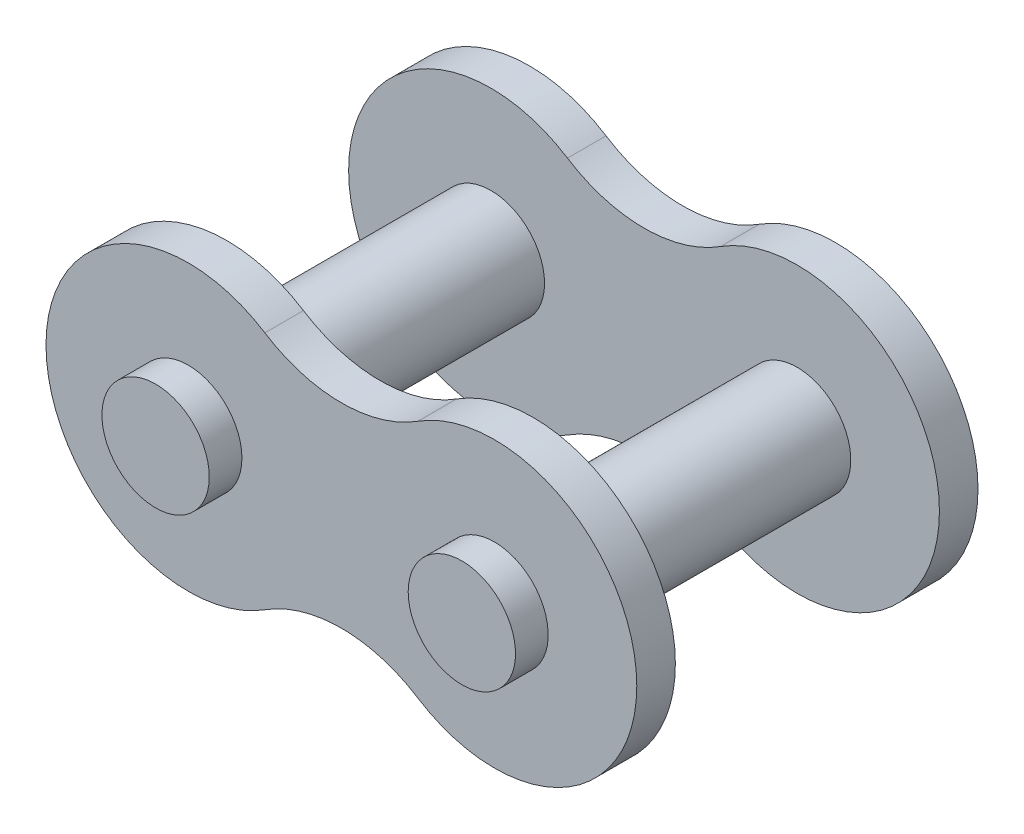
ISO-10303-21;
HEADER;
FILE_DESCRIPTION(('STEP AP214'),'2;1');
FILE_NAME('part.step','',(''),(''),'','','');
FILE_SCHEMA(('AUTOMOTIVE_DESIGN { 1 0 10303 214 1 1 1 1 }'));
ENDSEC;
DATA;
#1=APPLICATION_CONTEXT('core data for automotive mechanical design processes');
#2=APPLICATION_PROTOCOL_DEFINITION('international standard','automotive_design',2000,#1);
#3=PRODUCT_CONTEXT('',#1,'mechanical');
#4=PRODUCT('Part','Part','',(#3));
#5=PRODUCT_RELATED_PRODUCT_CATEGORY('part','',(#4));
#6=PRODUCT_DEFINITION_FORMATION('','',#4);
#7=PRODUCT_DEFINITION_CONTEXT('part definition',#1,'design');
#8=PRODUCT_DEFINITION('design','',#6,#7);
#9=PRODUCT_DEFINITION_SHAPE('','',#8);
#10=(LENGTH_UNIT() NAMED_UNIT(*) SI_UNIT(.MILLI.,.METRE.));
#11=(NAMED_UNIT(*) PLANE_ANGLE_UNIT() SI_UNIT($,.RADIAN.));
#12=(NAMED_UNIT(*) SI_UNIT($,.STERADIAN.) SOLID_ANGLE_UNIT());
#13=UNCERTAINTY_MEASURE_WITH_UNIT(LENGTH_MEASURE(1.E-05),#10,'distance_accuracy_value','');
#14=(GEOMETRIC_REPRESENTATION_CONTEXT(3) GLOBAL_UNCERTAINTY_ASSIGNED_CONTEXT((#13)) GLOBAL_UNIT_ASSIGNED_CONTEXT((#10,
#11,#12)) REPRESENTATION_CONTEXT('',''));
#15=CARTESIAN_POINT('',(0.,0.,0.));
#16=DIRECTION('',(0.,0.,1.));
#17=DIRECTION('',(1.,0.,0.));
#18=AXIS2_PLACEMENT_3D('',#15,#16,#17);
#19=CARTESIAN_POINT('',(-6.35,0.,-7.075));
#20=DIRECTION('',(0.,0.,1.));
#21=DIRECTION('',(1.,0.,0.));
#22=AXIS2_PLACEMENT_3D('',#19,#20,#21);
#23=CYLINDRICAL_SURFACE('',#22,5.9);
#24=CARTESIAN_POINT('',(-6.35,0.,-5.475));
#25=DIRECTION('',(0.,0.,1.));
#26=DIRECTION('',(1.,0.,0.));
#27=AXIS2_PLACEMENT_3D('',#24,#25,#26);
#28=CIRCLE('',#27,5.9);
#29=CARTESIAN_POINT('',(-3.175,4.97286386300691,-5.475));
#30=VERTEX_POINT('',#29);
#31=CARTESIAN_POINT('',(-3.175,-4.97286386300691,-5.475));
#32=VERTEX_POINT('',#31);
#33=EDGE_CURVE('E118',#30,#32,#28,.T.);
#34=ORIENTED_EDGE('',*,*,#33,.F.);
#35=DIRECTION('',(0.,0.,1.));
#36=VECTOR('',#35,1.);
#37=CARTESIAN_POINT('',(-3.175,4.97286386300691,-7.075));
#38=LINE('',#37,#36);
#39=CARTESIAN_POINT('',(-3.175,4.97286386300691,-7.075));
#40=VERTEX_POINT('',#39);
#41=EDGE_CURVE('E43',#40,#30,#38,.T.);
#42=ORIENTED_EDGE('',*,*,#41,.F.);
#43=CARTESIAN_POINT('',(-6.35,0.,-7.075));
#44=DIRECTION('',(0.,0.,1.));
#45=DIRECTION('',(1.,0.,0.));
#46=AXIS2_PLACEMENT_3D('',#43,#44,#45);
#47=CIRCLE('',#46,5.9);
#48=CARTESIAN_POINT('',(-3.175,-4.97286386300691,-7.075));
#49=VERTEX_POINT('',#48);
#50=EDGE_CURVE('E87',#40,#49,#47,.T.);
#51=ORIENTED_EDGE('',*,*,#50,.T.);
#52=DIRECTION('',(0.,0.,1.));
#53=VECTOR('',#52,1.);
#54=CARTESIAN_POINT('',(-3.175,-4.97286386300691,-7.075));
#55=LINE('',#54,#53);
#56=EDGE_CURVE('E58',#49,#32,#55,.T.);
#57=ORIENTED_EDGE('',*,*,#56,.T.);
#58=EDGE_LOOP('',(#34,#42,#51,#57));
#59=FACE_BOUND('',#58,.T.);
#60=ADVANCED_FACE('F35',(#59),#23,.T.);
#61=CARTESIAN_POINT('',(0.,9.94572772601382,-7.075));
#62=DIRECTION('',(0.,0.,1.));
#63=DIRECTION('',(1.,0.,0.));
#64=AXIS2_PLACEMENT_3D('',#61,#62,#63);
#65=CYLINDRICAL_SURFACE('',#64,5.9);
#66=CARTESIAN_POINT('',(0.,9.94572772601382,-5.475));
#67=DIRECTION('',(0.,0.,1.));
#68=DIRECTION('',(1.,0.,0.));
#69=AXIS2_PLACEMENT_3D('',#66,#67,#68);
#70=CIRCLE('',#69,5.9);
#71=CARTESIAN_POINT('',(3.175,4.97286386300691,-5.475));
#72=VERTEX_POINT('',#71);
#73=EDGE_CURVE('E79',#30,#72,#70,.T.);
#74=ORIENTED_EDGE('',*,*,#73,.T.);
#75=DIRECTION('',(0.,0.,1.));
#76=VECTOR('',#75,1.);
#77=CARTESIAN_POINT('',(3.175,4.97286386300691,-7.075));
#78=LINE('',#77,#76);
#79=CARTESIAN_POINT('',(3.175,4.97286386300691,-7.075));
#80=VERTEX_POINT('',#79);
#81=EDGE_CURVE('E82',#80,#72,#78,.T.);
#82=ORIENTED_EDGE('',*,*,#81,.F.);
#83=CARTESIAN_POINT('',(0.,9.94572772601382,-7.075));
#84=DIRECTION('',(0.,0.,1.));
#85=DIRECTION('',(1.,0.,0.));
#86=AXIS2_PLACEMENT_3D('',#83,#84,#85);
#87=CIRCLE('',#86,5.9);
#88=EDGE_CURVE('E66',#40,#80,#87,.T.);
#89=ORIENTED_EDGE('',*,*,#88,.F.);
#90=ORIENTED_EDGE('',*,*,#41,.T.);
#91=EDGE_LOOP('',(#74,#82,#89,#90));
#92=FACE_BOUND('',#91,.T.);
#93=ADVANCED_FACE('F81',(#92),#65,.F.);
#94=CARTESIAN_POINT('',(0.,-9.94572772601382,-7.075));
#95=DIRECTION('',(0.,0.,1.));
#96=DIRECTION('',(1.,0.,0.));
#97=AXIS2_PLACEMENT_3D('',#94,#95,#96);
#98=CYLINDRICAL_SURFACE('',#97,5.9);
#99=CARTESIAN_POINT('',(0.,-9.94572772601382,-5.475));
#100=DIRECTION('',(0.,0.,-1.));
#101=DIRECTION('',(-1.,0.,0.));
#102=AXIS2_PLACEMENT_3D('',#99,#100,#101);
#103=CIRCLE('',#102,5.9);
#104=CARTESIAN_POINT('',(3.175,-4.97286386300691,-5.475));
#105=VERTEX_POINT('',#104);
#106=EDGE_CURVE('E88',#32,#105,#103,.T.);
#107=ORIENTED_EDGE('',*,*,#106,.F.);
#108=ORIENTED_EDGE('',*,*,#56,.F.);
#109=CARTESIAN_POINT('',(0.,-9.94572772601382,-7.075));
#110=DIRECTION('',(0.,0.,-1.));
#111=DIRECTION('',(-1.,0.,0.));
#112=AXIS2_PLACEMENT_3D('',#109,#110,#111);
#113=CIRCLE('',#112,5.9);
#114=CARTESIAN_POINT('',(3.175,-4.97286386300691,-7.075));
#115=VERTEX_POINT('',#114);
#116=EDGE_CURVE('E120',#49,#115,#113,.T.);
#117=ORIENTED_EDGE('',*,*,#116,.T.);
#118=DIRECTION('',(0.,0.,1.));
#119=VECTOR('',#118,1.);
#120=CARTESIAN_POINT('',(3.175,-4.97286386300691,-7.075));
#121=LINE('',#120,#119);
#122=EDGE_CURVE('E97',#115,#105,#121,.T.);
#123=ORIENTED_EDGE('',*,*,#122,.T.);
#124=EDGE_LOOP('',(#107,#108,#117,#123));
#125=FACE_BOUND('',#124,.T.);
#126=ADVANCED_FACE('F129',(#125),#98,.F.);
#127=CARTESIAN_POINT('',(-6.35,0.,-7.075));
#128=DIRECTION('',(0.,0.,1.));
#129=DIRECTION('',(1.,0.,0.));
#130=AXIS2_PLACEMENT_3D('',#127,#128,#129);
#131=PLANE('',#130);
#132=CARTESIAN_POINT('',(-6.35,0.,-7.075));
#133=DIRECTION('',(0.,0.,1.));
#134=DIRECTION('',(1.,0.,0.));
#135=AXIS2_PLACEMENT_3D('',#132,#133,#134);
#136=CIRCLE('',#135,2.225);
#137=CARTESIAN_POINT('',(-4.125,0.,-7.075));
#138=VERTEX_POINT('',#137);
#139=EDGE_CURVE('E115',#138,#138,#136,.T.);
#140=ORIENTED_EDGE('',*,*,#139,.T.);
#141=EDGE_LOOP('',(#140));
#142=FACE_BOUND('',#141,.T.);
#143=ORIENTED_EDGE('',*,*,#50,.F.);
#144=ORIENTED_EDGE('',*,*,#88,.T.);
#145=CARTESIAN_POINT('',(6.35,0.,-7.075));
#146=DIRECTION('',(0.,0.,-1.));
#147=DIRECTION('',(-1.,0.,0.));
#148=AXIS2_PLACEMENT_3D('',#145,#146,#147);
#149=CIRCLE('',#148,5.9);
#150=EDGE_CURVE('E95',#80,#115,#149,.T.);
#151=ORIENTED_EDGE('',*,*,#150,.T.);
#152=ORIENTED_EDGE('',*,*,#116,.F.);
#153=EDGE_LOOP('',(#143,#144,#151,#152));
#154=FACE_BOUND('',#153,.T.);
#155=CARTESIAN_POINT('',(6.35,0.,-7.075));
#156=DIRECTION('',(0.,0.,-1.));
#157=DIRECTION('',(-1.,0.,0.));
#158=AXIS2_PLACEMENT_3D('',#155,#156,#157);
#159=CIRCLE('',#158,2.225);
#160=CARTESIAN_POINT('',(4.125,0.,-7.075));
#161=VERTEX_POINT('',#160);
#162=EDGE_CURVE('E102',#161,#161,#159,.T.);
#163=ORIENTED_EDGE('',*,*,#162,.F.);
#164=EDGE_LOOP('',(#163));
#165=FACE_BOUND('',#164,.T.);
#166=ADVANCED_FACE('F134',(#142,#154,#165),#131,.F.);
#167=CARTESIAN_POINT('',(-6.35,0.,-5.475));
#168=DIRECTION('',(0.,0.,1.));
#169=DIRECTION('',(1.,0.,0.));
#170=AXIS2_PLACEMENT_3D('',#167,#168,#169);
#171=PLANE('',#170);
#172=CARTESIAN_POINT('',(-6.35,0.,-5.475));
#173=DIRECTION('',(0.,0.,1.));
#174=DIRECTION('',(1.,0.,0.));
#175=AXIS2_PLACEMENT_3D('',#172,#173,#174);
#176=CIRCLE('',#175,2.225);
#177=CARTESIAN_POINT('',(-4.125,0.,-5.475));
#178=VERTEX_POINT('',#177);
#179=EDGE_CURVE('E11',#178,#178,#176,.T.);
#180=ORIENTED_EDGE('',*,*,#179,.F.);
#181=EDGE_LOOP('',(#180));
#182=FACE_BOUND('',#181,.T.);
#183=ORIENTED_EDGE('',*,*,#33,.T.);
#184=ORIENTED_EDGE('',*,*,#106,.T.);
#185=CARTESIAN_POINT('',(6.35,0.,-5.475));
#186=DIRECTION('',(0.,0.,-1.));
#187=DIRECTION('',(-1.,0.,0.));
#188=AXIS2_PLACEMENT_3D('',#185,#186,#187);
#189=CIRCLE('',#188,5.9);
#190=EDGE_CURVE('E94',#72,#105,#189,.T.);
#191=ORIENTED_EDGE('',*,*,#190,.F.);
#192=ORIENTED_EDGE('',*,*,#73,.F.);
#193=EDGE_LOOP('',(#183,#184,#191,#192));
#194=FACE_BOUND('',#193,.T.);
#195=CARTESIAN_POINT('',(6.35,0.,-5.475));
#196=DIRECTION('',(0.,0.,-1.));
#197=DIRECTION('',(-1.,0.,0.));
#198=AXIS2_PLACEMENT_3D('',#195,#196,#197);
#199=CIRCLE('',#198,2.225);
#200=CARTESIAN_POINT('',(4.125,0.,-5.475));
#201=VERTEX_POINT('',#200);
#202=EDGE_CURVE('E96',#201,#201,#199,.T.);
#203=ORIENTED_EDGE('',*,*,#202,.T.);
#204=EDGE_LOOP('',(#203));
#205=FACE_BOUND('',#204,.T.);
#206=ADVANCED_FACE('F99',(#182,#194,#205),#171,.T.);
#207=CARTESIAN_POINT('',(-6.35,0.,-8.43));
#208=DIRECTION('',(0.,0.,1.));
#209=DIRECTION('',(1.,0.,0.));
#210=AXIS2_PLACEMENT_3D('',#207,#208,#209);
#211=CYLINDRICAL_SURFACE('',#210,2.225);
#212=ORIENTED_EDGE('',*,*,#179,.T.);
#213=EDGE_LOOP('',(#212));
#214=FACE_BOUND('',#213,.T.);
#215=CARTESIAN_POINT('',(-6.35,0.,5.475));
#216=DIRECTION('',(0.,0.,1.));
#217=DIRECTION('',(1.,0.,0.));
#218=AXIS2_PLACEMENT_3D('',#215,#216,#217);
#219=CIRCLE('',#218,2.225);
#220=CARTESIAN_POINT('',(-4.125,0.,5.475));
#221=VERTEX_POINT('',#220);
#222=EDGE_CURVE('E255',#221,#221,#219,.T.);
#223=ORIENTED_EDGE('',*,*,#222,.F.);
#224=EDGE_LOOP('',(#223));
#225=FACE_BOUND('',#224,.T.);
#226=ADVANCED_FACE('F139',(#214,#225),#211,.T.);
#227=CARTESIAN_POINT('',(-6.35,0.,-8.43));
#228=DIRECTION('',(0.,0.,1.));
#229=DIRECTION('',(1.,0.,0.));
#230=AXIS2_PLACEMENT_3D('',#227,#228,#229);
#231=CIRCLE('',#230,2.225);
#232=CARTESIAN_POINT('',(-4.125,0.,-8.43));
#233=VERTEX_POINT('',#232);
#234=EDGE_CURVE('E112',#233,#233,#231,.T.);
#235=ORIENTED_EDGE('',*,*,#234,.T.);
#236=EDGE_LOOP('',(#235));
#237=FACE_BOUND('',#236,.T.);
#238=ORIENTED_EDGE('',*,*,#139,.F.);
#239=EDGE_LOOP('',(#238));
#240=FACE_BOUND('',#239,.T.);
#241=ADVANCED_FACE('F146',(#237,#240),#211,.T.);
#242=CARTESIAN_POINT('',(-6.35,0.,-8.43));
#243=DIRECTION('',(0.,0.,1.));
#244=DIRECTION('',(1.,0.,0.));
#245=AXIS2_PLACEMENT_3D('',#242,#243,#244);
#246=PLANE('',#245);
#247=ORIENTED_EDGE('',*,*,#234,.F.);
#248=EDGE_LOOP('',(#247));
#249=FACE_BOUND('',#248,.T.);
#250=ADVANCED_FACE('F148',(#249),#246,.F.);
#251=CARTESIAN_POINT('',(6.35,0.,-7.075));
#252=DIRECTION('',(0.,0.,1.));
#253=DIRECTION('',(-1.,0.,0.));
#254=AXIS2_PLACEMENT_3D('',#251,#252,#253);
#255=CYLINDRICAL_SURFACE('',#254,5.9);
#256=ORIENTED_EDGE('',*,*,#190,.T.);
#257=ORIENTED_EDGE('',*,*,#122,.F.);
#258=ORIENTED_EDGE('',*,*,#150,.F.);
#259=ORIENTED_EDGE('',*,*,#81,.T.);
#260=EDGE_LOOP('',(#256,#257,#258,#259));
#261=FACE_BOUND('',#260,.T.);
#262=ADVANCED_FACE('F92',(#261),#255,.T.);
#263=CARTESIAN_POINT('',(6.35,0.,-8.43));
#264=DIRECTION('',(0.,0.,1.));
#265=DIRECTION('',(-1.,0.,0.));
#266=AXIS2_PLACEMENT_3D('',#263,#264,#265);
#267=CYLINDRICAL_SURFACE('',#266,2.225);
#268=ORIENTED_EDGE('',*,*,#202,.F.);
#269=EDGE_LOOP('',(#268));
#270=FACE_BOUND('',#269,.T.);
#271=CARTESIAN_POINT('',(6.35,0.,5.475));
#272=DIRECTION('',(0.,0.,-1.));
#273=DIRECTION('',(-1.,0.,0.));
#274=AXIS2_PLACEMENT_3D('',#271,#272,#273);
#275=CIRCLE('',#274,2.225);
#276=CARTESIAN_POINT('',(4.125,0.,5.475));
#277=VERTEX_POINT('',#276);
#278=EDGE_CURVE('E222',#277,#277,#275,.T.);
#279=ORIENTED_EDGE('',*,*,#278,.T.);
#280=EDGE_LOOP('',(#279));
#281=FACE_BOUND('',#280,.T.);
#282=ADVANCED_FACE('F154',(#270,#281),#267,.T.);
#283=CARTESIAN_POINT('',(6.35,0.,-8.43));
#284=DIRECTION('',(0.,0.,-1.));
#285=DIRECTION('',(-1.,0.,0.));
#286=AXIS2_PLACEMENT_3D('',#283,#284,#285);
#287=CIRCLE('',#286,2.225);
#288=CARTESIAN_POINT('',(4.125,0.,-8.43));
#289=VERTEX_POINT('',#288);
#290=EDGE_CURVE('E106',#289,#289,#287,.T.);
#291=ORIENTED_EDGE('',*,*,#290,.F.);
#292=EDGE_LOOP('',(#291));
#293=FACE_BOUND('',#292,.T.);
#294=ORIENTED_EDGE('',*,*,#162,.T.);
#295=EDGE_LOOP('',(#294));
#296=FACE_BOUND('',#295,.T.);
#297=ADVANCED_FACE('F157',(#293,#296),#267,.T.);
#298=CARTESIAN_POINT('',(6.35,0.,-8.43));
#299=DIRECTION('',(0.,0.,1.));
#300=DIRECTION('',(-1.,0.,0.));
#301=AXIS2_PLACEMENT_3D('',#298,#299,#300);
#302=PLANE('',#301);
#303=ORIENTED_EDGE('',*,*,#290,.T.);
#304=EDGE_LOOP('',(#303));
#305=FACE_BOUND('',#304,.T.);
#306=ADVANCED_FACE('F159',(#305),#302,.F.);
#307=CARTESIAN_POINT('',(-6.35,0.,7.075));
#308=DIRECTION('',(0.,0.,-1.));
#309=DIRECTION('',(1.,0.,0.));
#310=AXIS2_PLACEMENT_3D('',#307,#308,#309);
#311=CYLINDRICAL_SURFACE('',#310,5.9);
#312=CARTESIAN_POINT('',(-6.35,0.,5.475));
#313=DIRECTION('',(0.,0.,1.));
#314=DIRECTION('',(1.,0.,0.));
#315=AXIS2_PLACEMENT_3D('',#312,#313,#314);
#316=CIRCLE('',#315,5.9);
#317=CARTESIAN_POINT('',(-3.175,4.97286386300691,5.475));
#318=VERTEX_POINT('',#317);
#319=CARTESIAN_POINT('',(-3.175,-4.97286386300691,5.475));
#320=VERTEX_POINT('',#319);
#321=EDGE_CURVE('E233',#318,#320,#316,.T.);
#322=ORIENTED_EDGE('',*,*,#321,.T.);
#323=DIRECTION('',(0.,0.,-1.));
#324=VECTOR('',#323,1.);
#325=CARTESIAN_POINT('',(-3.175,-4.97286386300691,7.075));
#326=LINE('',#325,#324);
#327=CARTESIAN_POINT('',(-3.175,-4.97286386300691,7.075));
#328=VERTEX_POINT('',#327);
#329=EDGE_CURVE('E244',#328,#320,#326,.T.);
#330=ORIENTED_EDGE('',*,*,#329,.F.);
#331=CARTESIAN_POINT('',(-6.35,0.,7.075));
#332=DIRECTION('',(0.,0.,1.));
#333=DIRECTION('',(1.,0.,0.));
#334=AXIS2_PLACEMENT_3D('',#331,#332,#333);
#335=CIRCLE('',#334,5.9);
#336=CARTESIAN_POINT('',(-3.175,4.97286386300691,7.075));
#337=VERTEX_POINT('',#336);
#338=EDGE_CURVE('E234',#337,#328,#335,.T.);
#339=ORIENTED_EDGE('',*,*,#338,.F.);
#340=DIRECTION('',(0.,0.,-1.));
#341=VECTOR('',#340,1.);
#342=CARTESIAN_POINT('',(-3.175,4.97286386300691,7.075));
#343=LINE('',#342,#341);
#344=EDGE_CURVE('E252',#337,#318,#343,.T.);
#345=ORIENTED_EDGE('',*,*,#344,.T.);
#346=EDGE_LOOP('',(#322,#330,#339,#345));
#347=FACE_BOUND('',#346,.T.);
#348=ADVANCED_FACE('F162',(#347),#311,.T.);
#349=CARTESIAN_POINT('',(0.,9.94572772601382,7.075));
#350=DIRECTION('',(0.,0.,-1.));
#351=DIRECTION('',(1.,0.,0.));
#352=AXIS2_PLACEMENT_3D('',#349,#350,#351);
#353=CYLINDRICAL_SURFACE('',#352,5.9);
#354=CARTESIAN_POINT('',(0.,9.94572772601382,5.475));
#355=DIRECTION('',(0.,0.,1.));
#356=DIRECTION('',(1.,0.,0.));
#357=AXIS2_PLACEMENT_3D('',#354,#355,#356);
#358=CIRCLE('',#357,5.9);
#359=CARTESIAN_POINT('',(3.175,4.97286386300691,5.475));
#360=VERTEX_POINT('',#359);
#361=EDGE_CURVE('E238',#318,#360,#358,.T.);
#362=ORIENTED_EDGE('',*,*,#361,.F.);
#363=ORIENTED_EDGE('',*,*,#344,.F.);
#364=CARTESIAN_POINT('',(0.,9.94572772601382,7.075));
#365=DIRECTION('',(0.,0.,1.));
#366=DIRECTION('',(1.,0.,0.));
#367=AXIS2_PLACEMENT_3D('',#364,#365,#366);
#368=CIRCLE('',#367,5.9);
#369=CARTESIAN_POINT('',(3.175,4.97286386300691,7.075));
#370=VERTEX_POINT('',#369);
#371=EDGE_CURVE('E241',#337,#370,#368,.T.);
#372=ORIENTED_EDGE('',*,*,#371,.T.);
#373=DIRECTION('',(0.,0.,-1.));
#374=VECTOR('',#373,1.);
#375=CARTESIAN_POINT('',(3.175,4.97286386300691,7.075));
#376=LINE('',#375,#374);
#377=EDGE_CURVE('E219',#370,#360,#376,.T.);
#378=ORIENTED_EDGE('',*,*,#377,.T.);
#379=EDGE_LOOP('',(#362,#363,#372,#378));
#380=FACE_BOUND('',#379,.T.);
#381=ADVANCED_FACE('F166',(#380),#353,.F.);
#382=CARTESIAN_POINT('',(0.,-9.94572772601382,7.075));
#383=DIRECTION('',(0.,0.,-1.));
#384=DIRECTION('',(1.,0.,0.));
#385=AXIS2_PLACEMENT_3D('',#382,#383,#384);
#386=CYLINDRICAL_SURFACE('',#385,5.9);
#387=CARTESIAN_POINT('',(0.,-9.94572772601382,5.475));
#388=DIRECTION('',(0.,0.,-1.));
#389=DIRECTION('',(-1.,0.,0.));
#390=AXIS2_PLACEMENT_3D('',#387,#388,#389);
#391=CIRCLE('',#390,5.9);
#392=CARTESIAN_POINT('',(3.175,-4.97286386300691,5.475));
#393=VERTEX_POINT('',#392);
#394=EDGE_CURVE('E247',#320,#393,#391,.T.);
#395=ORIENTED_EDGE('',*,*,#394,.T.);
#396=DIRECTION('',(0.,0.,-1.));
#397=VECTOR('',#396,1.);
#398=CARTESIAN_POINT('',(3.175,-4.97286386300691,7.075));
#399=LINE('',#398,#397);
#400=CARTESIAN_POINT('',(3.175,-4.97286386300691,7.075));
#401=VERTEX_POINT('',#400);
#402=EDGE_CURVE('E216',#401,#393,#399,.T.);
#403=ORIENTED_EDGE('',*,*,#402,.F.);
#404=CARTESIAN_POINT('',(0.,-9.94572772601382,7.075));
#405=DIRECTION('',(0.,0.,-1.));
#406=DIRECTION('',(-1.,0.,0.));
#407=AXIS2_PLACEMENT_3D('',#404,#405,#406);
#408=CIRCLE('',#407,5.9);
#409=EDGE_CURVE('E237',#328,#401,#408,.T.);
#410=ORIENTED_EDGE('',*,*,#409,.F.);
#411=ORIENTED_EDGE('',*,*,#329,.T.);
#412=EDGE_LOOP('',(#395,#403,#410,#411));
#413=FACE_BOUND('',#412,.T.);
#414=ADVANCED_FACE('F168',(#413),#386,.F.);
#415=CARTESIAN_POINT('',(-6.35,0.,7.075));
#416=DIRECTION('',(0.,0.,-1.));
#417=DIRECTION('',(1.,0.,0.));
#418=AXIS2_PLACEMENT_3D('',#415,#416,#417);
#419=PLANE('',#418);
#420=CARTESIAN_POINT('',(-6.35,0.,7.075));
#421=DIRECTION('',(0.,0.,1.));
#422=DIRECTION('',(1.,0.,0.));
#423=AXIS2_PLACEMENT_3D('',#420,#421,#422);
#424=CIRCLE('',#423,2.225);
#425=CARTESIAN_POINT('',(-4.125,0.,7.075));
#426=VERTEX_POINT('',#425);
#427=EDGE_CURVE('E230',#426,#426,#424,.T.);
#428=ORIENTED_EDGE('',*,*,#427,.F.);
#429=EDGE_LOOP('',(#428));
#430=FACE_BOUND('',#429,.T.);
#431=ORIENTED_EDGE('',*,*,#338,.T.);
#432=ORIENTED_EDGE('',*,*,#409,.T.);
#433=CARTESIAN_POINT('',(6.35,0.,7.075));
#434=DIRECTION('',(0.,0.,-1.));
#435=DIRECTION('',(-1.,0.,0.));
#436=AXIS2_PLACEMENT_3D('',#433,#434,#435);
#437=CIRCLE('',#436,5.9);
#438=EDGE_CURVE('E213',#370,#401,#437,.T.);
#439=ORIENTED_EDGE('',*,*,#438,.F.);
#440=ORIENTED_EDGE('',*,*,#371,.F.);
#441=EDGE_LOOP('',(#431,#432,#439,#440));
#442=FACE_BOUND('',#441,.T.);
#443=CARTESIAN_POINT('',(6.35,0.,7.075));
#444=DIRECTION('',(0.,0.,-1.));
#445=DIRECTION('',(-1.,0.,0.));
#446=AXIS2_PLACEMENT_3D('',#443,#444,#445);
#447=CIRCLE('',#446,2.225);
#448=CARTESIAN_POINT('',(4.125,0.,7.075));
#449=VERTEX_POINT('',#448);
#450=EDGE_CURVE('E207',#449,#449,#447,.T.);
#451=ORIENTED_EDGE('',*,*,#450,.T.);
#452=EDGE_LOOP('',(#451));
#453=FACE_BOUND('',#452,.T.);
#454=ADVANCED_FACE('F171',(#430,#442,#453),#419,.F.);
#455=CARTESIAN_POINT('',(-6.35,0.,5.475));
#456=DIRECTION('',(0.,0.,-1.));
#457=DIRECTION('',(1.,0.,0.));
#458=AXIS2_PLACEMENT_3D('',#455,#456,#457);
#459=PLANE('',#458);
#460=ORIENTED_EDGE('',*,*,#222,.T.);
#461=EDGE_LOOP('',(#460));
#462=FACE_BOUND('',#461,.T.);
#463=ORIENTED_EDGE('',*,*,#321,.F.);
#464=ORIENTED_EDGE('',*,*,#361,.T.);
#465=CARTESIAN_POINT('',(6.35,0.,5.475));
#466=DIRECTION('',(0.,0.,-1.));
#467=DIRECTION('',(-1.,0.,0.));
#468=AXIS2_PLACEMENT_3D('',#465,#466,#467);
#469=CIRCLE('',#468,5.9);
#470=EDGE_CURVE('E210',#360,#393,#469,.T.);
#471=ORIENTED_EDGE('',*,*,#470,.T.);
#472=ORIENTED_EDGE('',*,*,#394,.F.);
#473=EDGE_LOOP('',(#463,#464,#471,#472));
#474=FACE_BOUND('',#473,.T.);
#475=ORIENTED_EDGE('',*,*,#278,.F.);
#476=EDGE_LOOP('',(#475));
#477=FACE_BOUND('',#476,.T.);
#478=ADVANCED_FACE('F176',(#462,#474,#477),#459,.T.);
#479=CARTESIAN_POINT('',(-6.35,0.,8.43));
#480=DIRECTION('',(0.,0.,-1.));
#481=DIRECTION('',(1.,0.,0.));
#482=AXIS2_PLACEMENT_3D('',#479,#480,#481);
#483=CYLINDRICAL_SURFACE('',#482,2.225);
#484=CARTESIAN_POINT('',(-6.35,0.,8.43));
#485=DIRECTION('',(0.,0.,1.));
#486=DIRECTION('',(1.,0.,0.));
#487=AXIS2_PLACEMENT_3D('',#484,#485,#486);
#488=CIRCLE('',#487,2.225);
#489=CARTESIAN_POINT('',(-4.125,0.,8.43));
#490=VERTEX_POINT('',#489);
#491=EDGE_CURVE('E227',#490,#490,#488,.T.);
#492=ORIENTED_EDGE('',*,*,#491,.F.);
#493=EDGE_LOOP('',(#492));
#494=FACE_BOUND('',#493,.T.);
#495=ORIENTED_EDGE('',*,*,#427,.T.);
#496=EDGE_LOOP('',(#495));
#497=FACE_BOUND('',#496,.T.);
#498=ADVANCED_FACE('F179',(#494,#497),#483,.T.);
#499=CARTESIAN_POINT('',(-6.35,0.,8.43));
#500=DIRECTION('',(0.,0.,-1.));
#501=DIRECTION('',(1.,0.,0.));
#502=AXIS2_PLACEMENT_3D('',#499,#500,#501);
#503=PLANE('',#502);
#504=ORIENTED_EDGE('',*,*,#491,.T.);
#505=EDGE_LOOP('',(#504));
#506=FACE_BOUND('',#505,.T.);
#507=ADVANCED_FACE('F186',(#506),#503,.F.);
#508=CARTESIAN_POINT('',(6.35,0.,7.075));
#509=DIRECTION('',(0.,0.,-1.));
#510=DIRECTION('',(-1.,0.,0.));
#511=AXIS2_PLACEMENT_3D('',#508,#509,#510);
#512=CYLINDRICAL_SURFACE('',#511,5.9);
#513=ORIENTED_EDGE('',*,*,#470,.F.);
#514=ORIENTED_EDGE('',*,*,#377,.F.);
#515=ORIENTED_EDGE('',*,*,#438,.T.);
#516=ORIENTED_EDGE('',*,*,#402,.T.);
#517=EDGE_LOOP('',(#513,#514,#515,#516));
#518=FACE_BOUND('',#517,.T.);
#519=ADVANCED_FACE('F190',(#518),#512,.T.);
#520=CARTESIAN_POINT('',(6.35,0.,8.43));
#521=DIRECTION('',(0.,0.,-1.));
#522=DIRECTION('',(-1.,0.,0.));
#523=AXIS2_PLACEMENT_3D('',#520,#521,#522);
#524=CYLINDRICAL_SURFACE('',#523,2.225);
#525=CARTESIAN_POINT('',(6.35,0.,8.43));
#526=DIRECTION('',(0.,0.,-1.));
#527=DIRECTION('',(-1.,0.,0.));
#528=AXIS2_PLACEMENT_3D('',#525,#526,#527);
#529=CIRCLE('',#528,2.225);
#530=CARTESIAN_POINT('',(4.125,0.,8.43));
#531=VERTEX_POINT('',#530);
#532=EDGE_CURVE('E206',#531,#531,#529,.T.);
#533=ORIENTED_EDGE('',*,*,#532,.T.);
#534=EDGE_LOOP('',(#533));
#535=FACE_BOUND('',#534,.T.);
#536=ORIENTED_EDGE('',*,*,#450,.F.);
#537=EDGE_LOOP('',(#536));
#538=FACE_BOUND('',#537,.T.);
#539=ADVANCED_FACE('F194',(#535,#538),#524,.T.);
#540=CARTESIAN_POINT('',(6.35,0.,8.43));
#541=DIRECTION('',(0.,0.,-1.));
#542=DIRECTION('',(-1.,0.,0.));
#543=AXIS2_PLACEMENT_3D('',#540,#541,#542);
#544=PLANE('',#543);
#545=ORIENTED_EDGE('',*,*,#532,.F.);
#546=EDGE_LOOP('',(#545));
#547=FACE_BOUND('',#546,.T.);
#548=ADVANCED_FACE('F198',(#547),#544,.F.);
#549=CLOSED_SHELL('',(#60,#93,#126,#166,#206,#226,#241,#250,#262,#282,#297,#306,#348,#381,#414,
#454,#478,#498,#507,#519,#539,#548));
#550=MANIFOLD_SOLID_BREP('B2',#549);
#551=ADVANCED_BREP_SHAPE_REPRESENTATION('',(#18,#550),#14);
#552=SHAPE_DEFINITION_REPRESENTATION(#9,#551);
ENDSEC;
END-ISO-10303-21;
